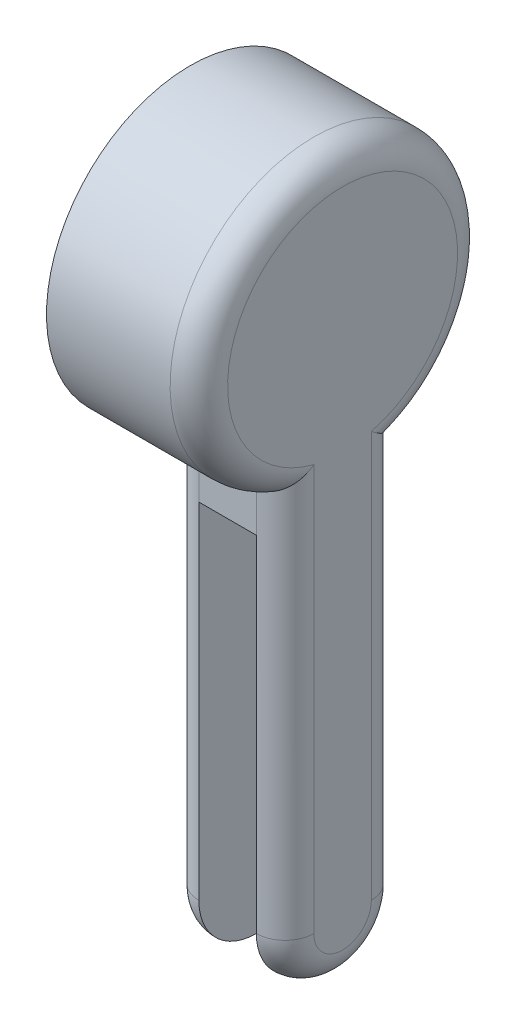
ISO-10303-21;
HEADER;
FILE_DESCRIPTION(('STEP AP214'),'2;1');
FILE_NAME('part.step','',(''),(''),'','','');
FILE_SCHEMA(('AUTOMOTIVE_DESIGN { 1 0 10303 214 1 1 1 1 }'));
ENDSEC;
DATA;
#1=APPLICATION_CONTEXT('core data for automotive mechanical design processes');
#2=APPLICATION_PROTOCOL_DEFINITION('international standard','automotive_design',2000,#1);
#3=PRODUCT_CONTEXT('',#1,'mechanical');
#4=PRODUCT('Part','Part','',(#3));
#5=PRODUCT_RELATED_PRODUCT_CATEGORY('part','',(#4));
#6=PRODUCT_DEFINITION_FORMATION('','',#4);
#7=PRODUCT_DEFINITION_CONTEXT('part definition',#1,'design');
#8=PRODUCT_DEFINITION('design','',#6,#7);
#9=PRODUCT_DEFINITION_SHAPE('','',#8);
#10=(LENGTH_UNIT() NAMED_UNIT(*) SI_UNIT(.MILLI.,.METRE.));
#11=(NAMED_UNIT(*) PLANE_ANGLE_UNIT() SI_UNIT($,.RADIAN.));
#12=(NAMED_UNIT(*) SI_UNIT($,.STERADIAN.) SOLID_ANGLE_UNIT());
#13=UNCERTAINTY_MEASURE_WITH_UNIT(LENGTH_MEASURE(1.E-05),#10,'distance_accuracy_value','');
#14=(GEOMETRIC_REPRESENTATION_CONTEXT(3) GLOBAL_UNCERTAINTY_ASSIGNED_CONTEXT((#13)) GLOBAL_UNIT_ASSIGNED_CONTEXT((#10,
#11,#12)) REPRESENTATION_CONTEXT('',''));
#15=CARTESIAN_POINT('',(0.,0.,0.));
#16=DIRECTION('',(0.,0.,1.));
#17=DIRECTION('',(1.,0.,0.));
#18=AXIS2_PLACEMENT_3D('',#15,#16,#17);
#19=CARTESIAN_POINT('',(53.,-180.,-20.));
#20=DIRECTION('',(0.,0.,1.));
#21=DIRECTION('',(1.,0.,0.));
#22=AXIS2_PLACEMENT_3D('',#19,#20,#21);
#23=PLANE('',#22);
#24=DIRECTION('',(-1.,0.,0.));
#25=VECTOR('',#24,1.);
#26=CARTESIAN_POINT('',(43.,-60.,-20.));
#27=LINE('',#26,#25);
#28=CARTESIAN_POINT('',(43.,-60.,-20.));
#29=VERTEX_POINT('',#28);
#30=CARTESIAN_POINT('',(23.,-60.,-20.));
#31=VERTEX_POINT('',#30);
#32=EDGE_CURVE('E337',#29,#31,#27,.T.);
#33=ORIENTED_EDGE('',*,*,#32,.T.);
#34=DIRECTION('',(0.,1.,0.));
#35=VECTOR('',#34,1.);
#36=CARTESIAN_POINT('',(23.,-180.,-20.));
#37=LINE('',#36,#35);
#38=CARTESIAN_POINT('',(23.,-45.8257569495584,-20.));
#39=VERTEX_POINT('',#38);
#40=EDGE_CURVE('E181',#31,#39,#37,.T.);
#41=ORIENTED_EDGE('',*,*,#40,.T.);
#42=DIRECTION('',(-1.,0.,0.));
#43=VECTOR('',#42,1.);
#44=CARTESIAN_POINT('',(53.,-45.8257569495584,-20.));
#45=LINE('',#44,#43);
#46=CARTESIAN_POINT('',(43.,-45.8257569495584,-20.));
#47=VERTEX_POINT('',#46);
#48=EDGE_CURVE('E344',#47,#39,#45,.T.);
#49=ORIENTED_EDGE('',*,*,#48,.F.);
#50=DIRECTION('',(0.,1.,0.));
#51=VECTOR('',#50,1.);
#52=CARTESIAN_POINT('',(43.,-180.,-20.));
#53=LINE('',#52,#51);
#54=EDGE_CURVE('E359',#47,#29,#53,.F.);
#55=ORIENTED_EDGE('',*,*,#54,.T.);
#56=EDGE_LOOP('',(#33,#41,#49,#55));
#57=FACE_BOUND('',#56,.T.);
#58=ADVANCED_FACE('F38',(#57),#23,.F.);
#59=CARTESIAN_POINT('',(53.,-180.,20.));
#60=DIRECTION('',(0.,0.,-1.));
#61=DIRECTION('',(-1.,0.,0.));
#62=AXIS2_PLACEMENT_3D('',#59,#60,#61);
#63=PLANE('',#62);
#64=DIRECTION('',(-1.,0.,0.));
#65=VECTOR('',#64,1.);
#66=CARTESIAN_POINT('',(53.,-45.8257569495584,20.));
#67=LINE('',#66,#65);
#68=CARTESIAN_POINT('',(43.,-45.8257569495584,20.));
#69=VERTEX_POINT('',#68);
#70=CARTESIAN_POINT('',(23.,-45.8257569495584,20.));
#71=VERTEX_POINT('',#70);
#72=EDGE_CURVE('E329',#69,#71,#67,.T.);
#73=ORIENTED_EDGE('',*,*,#72,.T.);
#74=DIRECTION('',(0.,-1.,0.));
#75=VECTOR('',#74,1.);
#76=CARTESIAN_POINT('',(23.,-180.,20.));
#77=LINE('',#76,#75);
#78=CARTESIAN_POINT('',(23.,-60.,20.));
#79=VERTEX_POINT('',#78);
#80=EDGE_CURVE('E199',#71,#79,#77,.T.);
#81=ORIENTED_EDGE('',*,*,#80,.T.);
#82=DIRECTION('',(-1.,0.,0.));
#83=VECTOR('',#82,1.);
#84=CARTESIAN_POINT('',(43.,-60.,20.));
#85=LINE('',#84,#83);
#86=CARTESIAN_POINT('',(43.,-60.,20.));
#87=VERTEX_POINT('',#86);
#88=EDGE_CURVE('E328',#87,#79,#85,.T.);
#89=ORIENTED_EDGE('',*,*,#88,.F.);
#90=DIRECTION('',(0.,-1.,0.));
#91=VECTOR('',#90,1.);
#92=CARTESIAN_POINT('',(43.,-45.8257569495584,20.));
#93=LINE('',#92,#91);
#94=EDGE_CURVE('E139',#87,#69,#93,.F.);
#95=ORIENTED_EDGE('',*,*,#94,.T.);
#96=EDGE_LOOP('',(#73,#81,#89,#95));
#97=FACE_BOUND('',#96,.T.);
#98=ADVANCED_FACE('F210',(#97),#63,.F.);
#99=CARTESIAN_POINT('',(13.,0.,0.));
#100=DIRECTION('',(-1.,0.,0.));
#101=DIRECTION('',(0.,0.,1.));
#102=AXIS2_PLACEMENT_3D('',#99,#100,#101);
#103=CYLINDRICAL_SURFACE('',#102,50.);
#104=ORIENTED_EDGE('',*,*,#72,.F.);
#105=CARTESIAN_POINT('',(43.,0.,0.));
#106=DIRECTION('',(1.,0.,0.));
#107=DIRECTION('',(0.,0.,-1.));
#108=AXIS2_PLACEMENT_3D('',#105,#106,#107);
#109=CIRCLE('',#108,50.);
#110=EDGE_CURVE('E153',#69,#47,#109,.F.);
#111=ORIENTED_EDGE('',*,*,#110,.T.);
#112=ORIENTED_EDGE('',*,*,#48,.T.);
#113=CARTESIAN_POINT('',(23.,-45.8257569495584,-20.));
#114=CARTESIAN_POINT('',(22.733172411891,-45.8257201786076,-20.0000417969106));
#115=CARTESIAN_POINT('',(22.4663627564171,-45.8304165320172,-19.9893223832669));
#116=CARTESIAN_POINT('',(21.9348447530826,-45.8490052105227,-19.9466717658857));
#117=CARTESIAN_POINT('',(21.6701357968663,-45.8628947670382,-19.9147469482544));
#118=CARTESIAN_POINT('',(21.1456552930297,-45.8995346485155,-19.8301464181386));
#119=CARTESIAN_POINT('',(20.8858695410568,-45.9222533059332,-19.7775448597637));
#120=CARTESIAN_POINT('',(20.372099606805,-45.9760543948196,-19.6521526004835));
#121=CARTESIAN_POINT('',(20.1181156607144,-46.0071371661308,-19.5793610792356));
#122=CARTESIAN_POINT('',(19.6179028616329,-46.0769953816135,-19.414388842686));
#123=CARTESIAN_POINT('',(19.3716667131745,-46.1157633218345,-19.3222270356669));
#124=CARTESIAN_POINT('',(18.888131762124,-46.2002717492914,-19.1192826739256));
#125=CARTESIAN_POINT('',(18.6508363430202,-46.2460148437686,-19.0084931547591));
#126=CARTESIAN_POINT('',(18.1865843622794,-46.3436404666926,-18.769221565506));
#127=CARTESIAN_POINT('',(17.9596306389994,-46.395524666723,-18.6407346767031));
#128=CARTESIAN_POINT('',(17.5172609662806,-46.5045564410429,-18.3670338344055));
#129=CARTESIAN_POINT('',(17.3018495469936,-46.5617060583289,-18.2218133827172));
#130=CARTESIAN_POINT('',(16.8745442337801,-46.6829500212233,-17.9089790772322));
#131=CARTESIAN_POINT('',(16.6632206133814,-46.747239162107,-17.7406617179133));
#132=CARTESIAN_POINT('',(16.2554312383863,-46.8795340144477,-17.3880636297082));
#133=CARTESIAN_POINT('',(16.0589720914856,-46.9475413558828,-17.203775878701));
#134=CARTESIAN_POINT('',(15.6819753077391,-47.0862335458558,-16.8204680912636));
#135=CARTESIAN_POINT('',(15.5014395774009,-47.156918713565,-16.621446295962));
#136=CARTESIAN_POINT('',(15.1572171513046,-47.2999675814883,-16.2098898243649));
#137=CARTESIAN_POINT('',(14.9935311472187,-47.3723313504588,-15.997354593929));
#138=CARTESIAN_POINT('',(14.6732490677567,-47.5227646527501,-15.5450137513294));
#139=CARTESIAN_POINT('',(14.5179052426721,-47.6008856908527,-15.3043372952467));
#140=CARTESIAN_POINT('',(14.2284379620141,-47.7568220483909,-14.8105688930386));
#141=CARTESIAN_POINT('',(14.0943075320133,-47.8346374600692,-14.5574810634602));
#142=CARTESIAN_POINT('',(13.8481234411305,-47.9889455615224,-14.0404373381537));
#143=CARTESIAN_POINT('',(13.7360672979555,-48.0654383991397,-13.7764826684615));
#144=CARTESIAN_POINT('',(13.5349034988885,-48.2161215661927,-13.2394609702587));
#145=CARTESIAN_POINT('',(13.4457850127287,-48.2903129676698,-12.9663983112364));
#146=CARTESIAN_POINT('',(13.3077590868018,-48.4199990300979,-12.4721410025646));
#147=CARTESIAN_POINT('',(13.254327627832,-48.4760963296847,-12.2523557309361));
#148=CARTESIAN_POINT('',(13.1624076665371,-48.5859685951876,-11.8091394952794));
#149=CARTESIAN_POINT('',(13.1239165514139,-48.6397439657042,-11.5857091758328));
#150=CARTESIAN_POINT('',(13.0621646334489,-48.7446297753596,-11.1361690714212));
#151=CARTESIAN_POINT('',(13.0389015528881,-48.7957406119906,-10.9100596923273));
#152=CARTESIAN_POINT('',(13.007811527566,-48.8950369481206,-10.4560812753516));
#153=CARTESIAN_POINT('',(12.999988752509,-48.9432216540045,-10.2282117788185));
#154=CARTESIAN_POINT('',(13.,-48.9897948556636,-10.));
#155=B_SPLINE_CURVE_WITH_KNOTS('',3,(#113,#114,#115,#116,#117,#118,#119,#120,#121,#122,#123,
#124,#125,#126,#127,#128,#129,#130,#131,#132,#133,#134,#135,#136,#137,#138,#139,#140,#141,#142,
#143,#144,#145,#146,#147,#148,#149,#150,#151,#152,#153,#154),.UNSPECIFIED.,.F.,.F.,(4,2,2,2,2,2,
2,2,2,2,2,2,2,2,2,2,2,2,2,2,4),(0.,0.800198389261815,1.60015590424418,2.39727028671569,
3.19441706164765,3.99078928690009,4.78745992096538,5.58434790635828,6.38154639919073,
7.21376717190406,8.04635574383077,8.87904386649081,9.71176615693086,10.6014885664538,
11.4909178469336,12.3802470523397,13.2691555776405,13.9677836149283,14.666289419598,
15.3646907220201,16.0632806041697),.UNSPECIFIED.);
#156=CARTESIAN_POINT('',(13.,-48.9897948556636,-10.));
#157=VERTEX_POINT('',#156);
#158=EDGE_CURVE('E48',#39,#157,#155,.T.);
#159=ORIENTED_EDGE('',*,*,#158,.T.);
#160=CARTESIAN_POINT('',(13.,0.,0.));
#161=DIRECTION('',(1.,0.,0.));
#162=DIRECTION('',(0.,0.,-1.));
#163=AXIS2_PLACEMENT_3D('',#160,#161,#162);
#164=CIRCLE('',#163,50.);
#165=CARTESIAN_POINT('',(13.,-48.9897948556636,9.99999999999998));
#166=VERTEX_POINT('',#165);
#167=EDGE_CURVE('E348',#166,#157,#164,.T.);
#168=ORIENTED_EDGE('',*,*,#167,.F.);
#169=CARTESIAN_POINT('',(13.,-48.9897948556636,9.99999999999998));
#170=CARTESIAN_POINT('',(12.9999711646464,-48.9306823137974,10.2897218792389));
#171=CARTESIAN_POINT('',(13.0125889412409,-48.8689557468884,10.5788780243558));
#172=CARTESIAN_POINT('',(13.0626184420573,-48.7409047169235,11.1539345090059));
#173=CARTESIAN_POINT('',(13.100023656346,-48.6745814651906,11.439835683345));
#174=CARTESIAN_POINT('',(13.1990425622559,-48.5380550763351,12.005916516337));
#175=CARTESIAN_POINT('',(13.2606137840736,-48.4678589305076,12.2861053102109));
#176=CARTESIAN_POINT('',(13.4073111638424,-48.3242308404643,12.8394067793973));
#177=CARTESIAN_POINT('',(13.492438492249,-48.2507987356127,13.1125191023567));
#178=CARTESIAN_POINT('',(13.6854286134939,-48.1016002570285,13.6496782732875));
#179=CARTESIAN_POINT('',(13.7932743618559,-48.0258356694225,13.913731745913));
#180=CARTESIAN_POINT('',(14.0309580429932,-47.8728226232139,14.4314148877676));
#181=CARTESIAN_POINT('',(14.1608035614203,-47.7955736609633,14.6850409239433));
#182=CARTESIAN_POINT('',(14.441610555564,-47.6406054098175,15.1802520492929));
#183=CARTESIAN_POINT('',(14.592576876446,-47.5628860169294,15.4218343583087));
#184=CARTESIAN_POINT('',(14.9146653219489,-47.408068867688,15.8913853468729));
#185=CARTESIAN_POINT('',(15.0857878494446,-47.330971123793,16.1193537541742));
#186=CARTESIAN_POINT('',(15.4511350542317,-47.1768691492842,16.5650179396242));
#187=CARTESIAN_POINT('',(15.6457824115839,-47.0999036806367,16.7823809467175));
#188=CARTESIAN_POINT('',(16.0538550193943,-46.9491029068784,17.1997372907047));
#189=CARTESIAN_POINT('',(16.2672737550504,-46.8752665288643,17.3997366063374));
#190=CARTESIAN_POINT('',(16.7117503616803,-46.7319827026518,17.7809810003146));
#191=CARTESIAN_POINT('',(16.9428134590642,-46.6625365661018,17.9622204840984));
#192=CARTESIAN_POINT('',(17.4210953654107,-46.5293928929305,18.3043520545763));
#193=CARTESIAN_POINT('',(17.6683132393237,-46.4656950241028,18.4652453173445));
#194=CARTESIAN_POINT('',(18.1709401852927,-46.3468721566981,18.761457314944));
#195=CARTESIAN_POINT('',(18.4259905237507,-46.2915727937897,18.8973143788695));
#196=CARTESIAN_POINT('',(18.9481908554879,-46.1888814647075,19.1469437971775));
#197=CARTESIAN_POINT('',(19.2153396369174,-46.1414887087799,19.2607183574629));
#198=CARTESIAN_POINT('',(19.7594410318066,-46.0557543674818,19.4648335315624));
#199=CARTESIAN_POINT('',(20.0363796693643,-46.0174004343493,19.5552061312249));
#200=CARTESIAN_POINT('',(20.5980732440866,-45.9506142393806,19.7116281822157));
#201=CARTESIAN_POINT('',(20.8828247342069,-45.9221776755634,19.7776881806137));
#202=CARTESIAN_POINT('',(21.4713765193304,-45.8748573444654,19.8872128432905));
#203=CARTESIAN_POINT('',(21.7754451103175,-45.8564821484919,19.9294772022673));
#204=CARTESIAN_POINT('',(22.2336255450516,-45.8380689418226,19.9717709950244));
#205=CARTESIAN_POINT('',(22.3866594958543,-45.8334561483077,19.9823517914708));
#206=CARTESIAN_POINT('',(22.6931198553567,-45.8272991439083,19.9964668411992));
#207=CARTESIAN_POINT('',(22.8465462800484,-45.8257550601245,20.0000008026137));
#208=CARTESIAN_POINT('',(23.,-45.8257569495584,20.));
#209=B_SPLINE_CURVE_WITH_KNOTS('',3,(#169,#170,#171,#172,#173,#174,#175,#176,#177,#178,#179,
#180,#181,#182,#183,#184,#185,#186,#187,#188,#189,#190,#191,#192,#193,#194,#195,#196,#197,#198,
#199,#200,#201,#202,#203,#204,#205,#206,#207,#208),.UNSPECIFIED.,.F.,.F.,(4,2,2,2,2,2,2,2,2,2,2,
2,2,2,2,2,2,2,2,4),(0.,0.886745482094388,1.77325817016698,2.65821981015372,3.54322542999487,
4.42756942485865,5.3122189696797,6.1970717891307,7.08194229770079,7.98612434335413,
8.88999381219723,9.79413206123015,10.6982180243845,11.5797263720483,12.4611466172078,
13.3413556995261,14.2211824862696,15.1421287956645,15.6023682998851,16.0626268660279),.UNSPECIFIED.);
#210=EDGE_CURVE('E11',#166,#71,#209,.T.);
#211=ORIENTED_EDGE('',*,*,#210,.T.);
#212=EDGE_LOOP('',(#104,#111,#112,#159,#168,#211));
#213=FACE_BOUND('',#212,.T.);
#214=CARTESIAN_POINT('',(0.,0.,0.));
#215=DIRECTION('',(1.,0.,0.));
#216=DIRECTION('',(0.,0.,-1.));
#217=AXIS2_PLACEMENT_3D('',#214,#215,#216);
#218=CIRCLE('',#217,50.);
#219=CARTESIAN_POINT('',(0.,0.,-50.));
#220=VERTEX_POINT('',#219);
#221=EDGE_CURVE('E347',#220,#220,#218,.T.);
#222=ORIENTED_EDGE('',*,*,#221,.T.);
#223=EDGE_LOOP('',(#222));
#224=FACE_BOUND('',#223,.T.);
#225=ADVANCED_FACE('F205',(#213,#224),#103,.T.);
#226=CARTESIAN_POINT('',(0.,0.,0.));
#227=DIRECTION('',(1.,0.,0.));
#228=DIRECTION('',(0.,0.,-1.));
#229=AXIS2_PLACEMENT_3D('',#226,#227,#228);
#230=PLANE('',#229);
#231=ORIENTED_EDGE('',*,*,#221,.F.);
#232=EDGE_LOOP('',(#231));
#233=FACE_BOUND('',#232,.T.);
#234=ADVANCED_FACE('F209',(#233),#230,.F.);
#235=CARTESIAN_POINT('',(13.,-180.,0.));
#236=DIRECTION('',(1.,0.,0.));
#237=DIRECTION('',(0.,0.,-1.));
#238=AXIS2_PLACEMENT_3D('',#235,#236,#237);
#239=PLANE('',#238);
#240=ORIENTED_EDGE('',*,*,#167,.T.);
#241=DIRECTION('',(0.,1.,0.));
#242=VECTOR('',#241,1.);
#243=CARTESIAN_POINT('',(13.,-180.,-10.));
#244=LINE('',#243,#242);
#245=CARTESIAN_POINT('',(13.,-180.,-10.));
#246=VERTEX_POINT('',#245);
#247=EDGE_CURVE('E62',#157,#246,#244,.F.);
#248=ORIENTED_EDGE('',*,*,#247,.T.);
#249=CARTESIAN_POINT('',(13.,-180.,0.));
#250=DIRECTION('',(1.,0.,0.));
#251=DIRECTION('',(0.,0.,-1.));
#252=AXIS2_PLACEMENT_3D('',#249,#250,#251);
#253=CIRCLE('',#252,10.);
#254=CARTESIAN_POINT('',(13.,-180.,9.99999999999998));
#255=VERTEX_POINT('',#254);
#256=EDGE_CURVE('E318',#246,#255,#253,.F.);
#257=ORIENTED_EDGE('',*,*,#256,.T.);
#258=DIRECTION('',(0.,-1.,0.));
#259=VECTOR('',#258,1.);
#260=CARTESIAN_POINT('',(13.,-180.,9.99999999999998));
#261=LINE('',#260,#259);
#262=EDGE_CURVE('E324',#255,#166,#261,.F.);
#263=ORIENTED_EDGE('',*,*,#262,.T.);
#264=EDGE_LOOP('',(#240,#248,#257,#263));
#265=FACE_BOUND('',#264,.T.);
#266=ADVANCED_FACE('F214',(#265),#239,.F.);
#267=CARTESIAN_POINT('',(53.,-180.,0.));
#268=DIRECTION('',(1.,0.,0.));
#269=DIRECTION('',(0.,0.,-1.));
#270=AXIS2_PLACEMENT_3D('',#267,#268,#269);
#271=PLANE('',#270);
#272=CARTESIAN_POINT('',(53.,0.,0.));
#273=DIRECTION('',(1.,0.,0.));
#274=DIRECTION('',(0.,0.,-1.));
#275=AXIS2_PLACEMENT_3D('',#272,#273,#274);
#276=CIRCLE('',#275,40.);
#277=CARTESIAN_POINT('',(53.,-38.7298334620742,-10.));
#278=VERTEX_POINT('',#277);
#279=CARTESIAN_POINT('',(53.,-38.7298334620742,9.99999999999998));
#280=VERTEX_POINT('',#279);
#281=EDGE_CURVE('E350',#278,#280,#276,.T.);
#282=ORIENTED_EDGE('',*,*,#281,.T.);
#283=DIRECTION('',(0.,-1.,0.));
#284=VECTOR('',#283,1.);
#285=CARTESIAN_POINT('',(53.,-180.,9.99999999999998));
#286=LINE('',#285,#284);
#287=CARTESIAN_POINT('',(53.,-180.,9.99999999999998));
#288=VERTEX_POINT('',#287);
#289=EDGE_CURVE('E357',#280,#288,#286,.T.);
#290=ORIENTED_EDGE('',*,*,#289,.T.);
#291=CARTESIAN_POINT('',(53.,-180.,0.));
#292=DIRECTION('',(1.,0.,0.));
#293=DIRECTION('',(0.,0.,-1.));
#294=AXIS2_PLACEMENT_3D('',#291,#292,#293);
#295=CIRCLE('',#294,10.);
#296=CARTESIAN_POINT('',(53.,-180.,-10.));
#297=VERTEX_POINT('',#296);
#298=EDGE_CURVE('E144',#288,#297,#295,.T.);
#299=ORIENTED_EDGE('',*,*,#298,.T.);
#300=DIRECTION('',(0.,1.,0.));
#301=VECTOR('',#300,1.);
#302=CARTESIAN_POINT('',(53.,-45.8257569495584,-10.));
#303=LINE('',#302,#301);
#304=EDGE_CURVE('E354',#297,#278,#303,.T.);
#305=ORIENTED_EDGE('',*,*,#304,.T.);
#306=EDGE_LOOP('',(#282,#290,#299,#305));
#307=FACE_BOUND('',#306,.T.);
#308=ADVANCED_FACE('F224',(#307),#271,.T.);
#309=CARTESIAN_POINT('',(43.,-60.,20.));
#310=DIRECTION('',(0.,1.,0.));
#311=DIRECTION('',(0.,0.,1.));
#312=AXIS2_PLACEMENT_3D('',#309,#310,#311);
#313=PLANE('',#312);
#314=DIRECTION('',(0.,0.,-1.));
#315=VECTOR('',#314,1.);
#316=CARTESIAN_POINT('',(23.,-60.,20.));
#317=LINE('',#316,#315);
#318=EDGE_CURVE('E332',#79,#31,#317,.T.);
#319=ORIENTED_EDGE('',*,*,#318,.T.);
#320=ORIENTED_EDGE('',*,*,#32,.F.);
#321=DIRECTION('',(0.,0.,-1.));
#322=VECTOR('',#321,1.);
#323=CARTESIAN_POINT('',(43.,-60.,20.));
#324=LINE('',#323,#322);
#325=EDGE_CURVE('E141',#87,#29,#324,.T.);
#326=ORIENTED_EDGE('',*,*,#325,.F.);
#327=ORIENTED_EDGE('',*,*,#88,.T.);
#328=EDGE_LOOP('',(#319,#320,#326,#327));
#329=FACE_BOUND('',#328,.T.);
#330=ADVANCED_FACE('F227',(#329),#313,.F.);
#331=CARTESIAN_POINT('',(43.,-180.,0.));
#332=DIRECTION('',(-1.,0.,0.));
#333=DIRECTION('',(0.,0.,1.));
#334=AXIS2_PLACEMENT_3D('',#331,#332,#333);
#335=PLANE('',#334);
#336=CARTESIAN_POINT('',(43.,-180.,0.));
#337=DIRECTION('',(-1.,0.,0.));
#338=DIRECTION('',(0.,0.,1.));
#339=AXIS2_PLACEMENT_3D('',#336,#337,#338);
#340=CIRCLE('',#339,20.);
#341=CARTESIAN_POINT('',(43.,-180.,-20.));
#342=VERTEX_POINT('',#341);
#343=CARTESIAN_POINT('',(43.,-180.,20.));
#344=VERTEX_POINT('',#343);
#345=EDGE_CURVE('E119',#342,#344,#340,.T.);
#346=ORIENTED_EDGE('',*,*,#345,.T.);
#347=DIRECTION('',(0.,1.,0.));
#348=VECTOR('',#347,1.);
#349=CARTESIAN_POINT('',(43.,-180.,20.));
#350=LINE('',#349,#348);
#351=EDGE_CURVE('E123',#344,#87,#350,.T.);
#352=ORIENTED_EDGE('',*,*,#351,.T.);
#353=ORIENTED_EDGE('',*,*,#325,.T.);
#354=DIRECTION('',(0.,-1.,0.));
#355=VECTOR('',#354,1.);
#356=CARTESIAN_POINT('',(43.,-60.,-20.));
#357=LINE('',#356,#355);
#358=EDGE_CURVE('E126',#29,#342,#357,.T.);
#359=ORIENTED_EDGE('',*,*,#358,.T.);
#360=EDGE_LOOP('',(#346,#352,#353,#359));
#361=FACE_BOUND('',#360,.T.);
#362=ADVANCED_FACE('F121',(#361),#335,.T.);
#363=CARTESIAN_POINT('',(23.,-180.,0.));
#364=DIRECTION('',(-1.,0.,0.));
#365=DIRECTION('',(0.,0.,1.));
#366=AXIS2_PLACEMENT_3D('',#363,#364,#365);
#367=PLANE('',#366);
#368=CARTESIAN_POINT('',(23.,-180.,0.));
#369=DIRECTION('',(-1.,0.,0.));
#370=DIRECTION('',(0.,0.,1.));
#371=AXIS2_PLACEMENT_3D('',#368,#369,#370);
#372=CIRCLE('',#371,20.);
#373=CARTESIAN_POINT('',(23.,-180.,-20.));
#374=VERTEX_POINT('',#373);
#375=CARTESIAN_POINT('',(23.,-180.,20.));
#376=VERTEX_POINT('',#375);
#377=EDGE_CURVE('E180',#374,#376,#372,.T.);
#378=ORIENTED_EDGE('',*,*,#377,.F.);
#379=DIRECTION('',(0.,-1.,0.));
#380=VECTOR('',#379,1.);
#381=CARTESIAN_POINT('',(23.,-60.,-20.));
#382=LINE('',#381,#380);
#383=EDGE_CURVE('E131',#31,#374,#382,.T.);
#384=ORIENTED_EDGE('',*,*,#383,.F.);
#385=ORIENTED_EDGE('',*,*,#318,.F.);
#386=DIRECTION('',(0.,1.,0.));
#387=VECTOR('',#386,1.);
#388=CARTESIAN_POINT('',(23.,-180.,20.));
#389=LINE('',#388,#387);
#390=EDGE_CURVE('E323',#376,#79,#389,.T.);
#391=ORIENTED_EDGE('',*,*,#390,.F.);
#392=EDGE_LOOP('',(#378,#384,#385,#391));
#393=FACE_BOUND('',#392,.T.);
#394=ADVANCED_FACE('F186',(#393),#367,.F.);
#395=CARTESIAN_POINT('',(43.,-180.,-10.));
#396=DIRECTION('',(0.,-1.,0.));
#397=DIRECTION('',(0.,0.,-1.));
#398=AXIS2_PLACEMENT_3D('',#395,#396,#397);
#399=CYLINDRICAL_SURFACE('',#398,10.);
#400=ORIENTED_EDGE('',*,*,#358,.F.);
#401=ORIENTED_EDGE('',*,*,#54,.F.);
#402=CARTESIAN_POINT('',(43.,-45.8257569495584,-20.));
#403=CARTESIAN_POINT('',(43.1237761906737,-45.8257573549389,-20.0000009798277));
#404=CARTESIAN_POINT('',(43.2475356709395,-45.8242521864083,-19.997701391254));
#405=CARTESIAN_POINT('',(43.4948084849058,-45.8182390808218,-19.988516989277));
#406=CARTESIAN_POINT('',(43.6183218242628,-45.8137312135848,-19.9816322824872));
#407=CARTESIAN_POINT('',(43.9880346760222,-45.7957232123601,-19.9541351624558));
#408=CARTESIAN_POINT('',(44.2335556270845,-45.777738657232,-19.9266797095041));
#409=CARTESIAN_POINT('',(44.7196039938604,-45.7301427635176,-19.8540899742878));
#410=CARTESIAN_POINT('',(44.9601493251192,-45.7005858974201,-19.8090385212401));
#411=CARTESIAN_POINT('',(45.435739974872,-45.6301914230334,-19.7018855281728));
#412=CARTESIAN_POINT('',(45.6707850234649,-45.5893532624203,-19.6397831533533));
#413=CARTESIAN_POINT('',(46.1334801862071,-45.4969178914732,-19.499456785894));
#414=CARTESIAN_POINT('',(46.3611394708155,-45.4453346636971,-19.4212537465751));
#415=CARTESIAN_POINT('',(46.8080974860876,-45.3319009441147,-19.2496337917041));
#416=CARTESIAN_POINT('',(47.0273930012703,-45.2700465514892,-19.1562110962334));
#417=CARTESIAN_POINT('',(47.4564905693584,-45.136651283456,-18.9552140156089));
#418=CARTESIAN_POINT('',(47.6662870380165,-45.0651048064863,-18.8476314477535));
#419=CARTESIAN_POINT('',(48.0753102253933,-44.9129916434237,-18.6195172251371));
#420=CARTESIAN_POINT('',(48.2745357806984,-44.8324239674981,-18.4989841494667));
#421=CARTESIAN_POINT('',(48.6723412925707,-44.6582424581677,-18.2391771521714));
#422=CARTESIAN_POINT('',(48.8702776504168,-44.5641538024964,-18.0992357859871));
#423=CARTESIAN_POINT('',(49.252821427956,-44.3674591155988,-17.8076956824475));
#424=CARTESIAN_POINT('',(49.4374281538179,-44.2648526416017,-17.6560963391204));
#425=CARTESIAN_POINT('',(49.9705280436353,-43.945359789664,-17.1858232411068));
#426=CARTESIAN_POINT('',(50.2984923717943,-43.7167152117221,-16.8515475181961));
#427=CARTESIAN_POINT('',(50.9427365755085,-43.1972407919294,-16.098739337094));
#428=CARTESIAN_POINT('',(51.2496388511132,-42.9022430000191,-15.6751267589746));
#429=CARTESIAN_POINT('',(51.7878413057122,-42.2857387867787,-14.7998085799085));
#430=CARTESIAN_POINT('',(52.0190658693227,-41.9642062516722,-14.3480754145215));
#431=CARTESIAN_POINT('',(52.4424084806215,-41.2413367013629,-13.3449151020652));
#432=CARTESIAN_POINT('',(52.6199569636576,-40.8360639344824,-12.7901991398613));
#433=CARTESIAN_POINT('',(52.8756601401657,-40.0069581468251,-11.6730860176179));
#434=CARTESIAN_POINT('',(52.9539406158997,-39.5831493192645,-11.1106994925666));
#435=CARTESIAN_POINT('',(52.994670909981,-39.0172927585095,-10.3721718124532));
#436=CARTESIAN_POINT('',(52.9997013110605,-38.8800191290259,-10.1939485316357));
#437=CARTESIAN_POINT('',(52.999995694678,-38.7381308244658,-10.0107127110577));
#438=CARTESIAN_POINT('',(52.9999999979034,-38.7339823538704,-10.0053561979218));
#439=CARTESIAN_POINT('',(53.,-38.7298334620742,-10.));
#440=B_SPLINE_CURVE_WITH_KNOTS('',3,(#402,#403,#404,#405,#406,#407,#408,#409,#410,#411,#412,
#413,#414,#415,#416,#417,#418,#419,#420,#421,#422,#423,#424,#425,#426,#427,#428,#429,#430,#431,
#432,#433,#434,#435,#436,#437,#438,#439),.UNSPECIFIED.,.F.,.F.,(4,2,2,2,2,2,2,2,2,2,2,2,2,2,2,2,
2,2,4),(0.,0.371264884866302,0.742521137354679,1.48458940914703,2.22320586331833,
2.96185848601962,3.69955583837828,4.43753399951237,5.17594051111011,5.91442812240139,
6.69371003419391,7.47303247981004,9.03095010136926,10.8260105154985,12.6228590746228,
14.7437086343091,16.8618681764454,17.536791511739,17.5571168258276),.UNSPECIFIED.);
#441=EDGE_CURVE('E173',#278,#47,#440,.F.);
#442=ORIENTED_EDGE('',*,*,#441,.F.);
#443=ORIENTED_EDGE('',*,*,#304,.F.);
#444=CARTESIAN_POINT('',(43.,-180.,-10.));
#445=DIRECTION('',(0.,-1.,0.));
#446=DIRECTION('',(0.,0.,-1.));
#447=AXIS2_PLACEMENT_3D('',#444,#445,#446);
#448=CIRCLE('',#447,10.);
#449=EDGE_CURVE('E148',#342,#297,#448,.T.);
#450=ORIENTED_EDGE('',*,*,#449,.F.);
#451=EDGE_LOOP('',(#400,#401,#442,#443,#450));
#452=FACE_BOUND('',#451,.T.);
#453=ADVANCED_FACE('F169',(#452),#399,.T.);
#454=CARTESIAN_POINT('',(43.,0.,0.));
#455=DIRECTION('',(1.,0.,0.));
#456=DIRECTION('',(0.,0.,-1.));
#457=AXIS2_PLACEMENT_3D('',#454,#455,#456);
#458=TOROIDAL_SURFACE('',#457,40.,10.);
#459=ORIENTED_EDGE('',*,*,#441,.T.);
#460=ORIENTED_EDGE('',*,*,#110,.F.);
#461=CARTESIAN_POINT('',(43.,-45.8257569495584,20.));
#462=CARTESIAN_POINT('',(43.1237761906737,-45.8257573549389,20.0000009798276));
#463=CARTESIAN_POINT('',(43.2475356709395,-45.8242521864083,19.9977013912539));
#464=CARTESIAN_POINT('',(43.4948084849058,-45.8182390808218,19.988516989277));
#465=CARTESIAN_POINT('',(43.6183218242628,-45.8137312135848,19.9816322824872));
#466=CARTESIAN_POINT('',(43.9880346760222,-45.7957232123601,19.9541351624557));
#467=CARTESIAN_POINT('',(44.2335556270845,-45.777738657232,19.9266797095041));
#468=CARTESIAN_POINT('',(44.7196039938604,-45.7301427635176,19.8540899742877));
#469=CARTESIAN_POINT('',(44.9601493251192,-45.7005858974201,19.8090385212401));
#470=CARTESIAN_POINT('',(45.435739974872,-45.6301914230334,19.7018855281727));
#471=CARTESIAN_POINT('',(45.6707850234649,-45.5893532624203,19.6397831533533));
#472=CARTESIAN_POINT('',(46.1334801862071,-45.4969178914732,19.4994567858939));
#473=CARTESIAN_POINT('',(46.3611394708155,-45.4453346636971,19.421253746575));
#474=CARTESIAN_POINT('',(46.8080974860876,-45.3319009441147,19.2496337917041));
#475=CARTESIAN_POINT('',(47.0273930012703,-45.2700465514892,19.1562110962334));
#476=CARTESIAN_POINT('',(47.4564905693584,-45.136651283456,18.9552140156088));
#477=CARTESIAN_POINT('',(47.6662870380165,-45.0651048064863,18.8476314477535));
#478=CARTESIAN_POINT('',(48.0753102253933,-44.9129916434237,18.6195172251371));
#479=CARTESIAN_POINT('',(48.2745357806984,-44.8324239674981,18.4989841494667));
#480=CARTESIAN_POINT('',(48.6723412925707,-44.6582424581677,18.2391771521713));
#481=CARTESIAN_POINT('',(48.8702776504168,-44.5641538024964,18.0992357859871));
#482=CARTESIAN_POINT('',(49.252821427956,-44.3674591155989,17.8076956824475));
#483=CARTESIAN_POINT('',(49.4374281538179,-44.2648526416017,17.6560963391204));
#484=CARTESIAN_POINT('',(49.9705280436353,-43.945359789664,17.1858232411067));
#485=CARTESIAN_POINT('',(50.2984923717943,-43.7167152117221,16.8515475181961));
#486=CARTESIAN_POINT('',(50.9427365755085,-43.1972407919294,16.098739337094));
#487=CARTESIAN_POINT('',(51.2496388511132,-42.9022430000191,15.6751267589746));
#488=CARTESIAN_POINT('',(51.7878413057122,-42.2857387867787,14.7998085799085));
#489=CARTESIAN_POINT('',(52.0190658693227,-41.9642062516722,14.3480754145215));
#490=CARTESIAN_POINT('',(52.4424084806215,-41.2413367013629,13.3449151020651));
#491=CARTESIAN_POINT('',(52.6199569636576,-40.8360639344825,12.7901991398612));
#492=CARTESIAN_POINT('',(52.8756601401657,-40.0069581468251,11.6730860176179));
#493=CARTESIAN_POINT('',(52.9539406158997,-39.5831493192644,11.1106994925667));
#494=CARTESIAN_POINT('',(52.994670909981,-39.0172927585096,10.3721718124531));
#495=CARTESIAN_POINT('',(52.9997013110605,-38.8800191290261,10.1939485316356));
#496=CARTESIAN_POINT('',(52.999995694678,-38.7381308244659,10.0107127110576));
#497=CARTESIAN_POINT('',(52.9999999979034,-38.7339823538704,10.0053561979217));
#498=CARTESIAN_POINT('',(53.,-38.7298334620742,9.99999999999998));
#499=B_SPLINE_CURVE_WITH_KNOTS('',3,(#461,#462,#463,#464,#465,#466,#467,#468,#469,#470,#471,
#472,#473,#474,#475,#476,#477,#478,#479,#480,#481,#482,#483,#484,#485,#486,#487,#488,#489,#490,
#491,#492,#493,#494,#495,#496,#497,#498),.UNSPECIFIED.,.F.,.F.,(4,2,2,2,2,2,2,2,2,2,2,2,2,2,2,2,
2,2,4),(0.,0.371264884866302,0.742521137354678,1.48458940914703,2.22320586331833,
2.96185848601962,3.69955583837828,4.43753399951237,5.17594051111011,5.91442812240138,
6.6937100341939,7.47303247981004,9.03095010136926,10.8260105154985,12.6228590746228,
14.7437086343091,16.8618681764454,17.536791511739,17.5571168258276),.UNSPECIFIED.);
#500=EDGE_CURVE('E146',#280,#69,#499,.F.);
#501=ORIENTED_EDGE('',*,*,#500,.F.);
#502=ORIENTED_EDGE('',*,*,#281,.F.);
#503=EDGE_LOOP('',(#459,#460,#501,#502));
#504=FACE_BOUND('',#503,.T.);
#505=ADVANCED_FACE('F165',(#504),#458,.T.);
#506=CARTESIAN_POINT('',(43.,-180.,0.));
#507=DIRECTION('',(1.,0.,0.));
#508=DIRECTION('',(0.,0.,-1.));
#509=AXIS2_PLACEMENT_3D('',#506,#507,#508);
#510=DEGENERATE_TOROIDAL_SURFACE('',#509,10.,10.,.T.);
#511=ORIENTED_EDGE('',*,*,#449,.T.);
#512=ORIENTED_EDGE('',*,*,#298,.F.);
#513=CARTESIAN_POINT('',(43.,-180.,9.99999999999998));
#514=DIRECTION('',(0.,1.,0.));
#515=DIRECTION('',(0.,0.,1.));
#516=AXIS2_PLACEMENT_3D('',#513,#514,#515);
#517=CIRCLE('',#516,10.);
#518=EDGE_CURVE('E136',#344,#288,#517,.T.);
#519=ORIENTED_EDGE('',*,*,#518,.F.);
#520=ORIENTED_EDGE('',*,*,#345,.F.);
#521=EDGE_LOOP('',(#511,#512,#519,#520));
#522=FACE_BOUND('',#521,.T.);
#523=ADVANCED_FACE('F143',(#522),#510,.T.);
#524=CARTESIAN_POINT('',(43.,-180.,9.99999999999998));
#525=DIRECTION('',(0.,1.,0.));
#526=DIRECTION('',(0.,0.,1.));
#527=AXIS2_PLACEMENT_3D('',#524,#525,#526);
#528=CYLINDRICAL_SURFACE('',#527,10.);
#529=ORIENTED_EDGE('',*,*,#94,.F.);
#530=ORIENTED_EDGE('',*,*,#351,.F.);
#531=ORIENTED_EDGE('',*,*,#518,.T.);
#532=ORIENTED_EDGE('',*,*,#289,.F.);
#533=ORIENTED_EDGE('',*,*,#500,.T.);
#534=EDGE_LOOP('',(#529,#530,#531,#532,#533));
#535=FACE_BOUND('',#534,.T.);
#536=ADVANCED_FACE('F134',(#535),#528,.T.);
#537=CARTESIAN_POINT('',(23.,-180.,9.99999999999998));
#538=DIRECTION('',(0.,-1.,0.));
#539=DIRECTION('',(0.,0.,-1.));
#540=AXIS2_PLACEMENT_3D('',#537,#538,#539);
#541=CYLINDRICAL_SURFACE('',#540,10.);
#542=ORIENTED_EDGE('',*,*,#210,.F.);
#543=ORIENTED_EDGE('',*,*,#262,.F.);
#544=CARTESIAN_POINT('',(23.,-180.,9.99999999999998));
#545=DIRECTION('',(0.,-1.,0.));
#546=DIRECTION('',(0.,0.,-1.));
#547=AXIS2_PLACEMENT_3D('',#544,#545,#546);
#548=CIRCLE('',#547,10.);
#549=EDGE_CURVE('E43',#376,#255,#548,.T.);
#550=ORIENTED_EDGE('',*,*,#549,.F.);
#551=ORIENTED_EDGE('',*,*,#390,.T.);
#552=ORIENTED_EDGE('',*,*,#80,.F.);
#553=EDGE_LOOP('',(#542,#543,#550,#551,#552));
#554=FACE_BOUND('',#553,.T.);
#555=ADVANCED_FACE('F40',(#554),#541,.T.);
#556=CARTESIAN_POINT('',(23.,-180.,0.));
#557=DIRECTION('',(1.,0.,0.));
#558=DIRECTION('',(0.,0.,-1.));
#559=AXIS2_PLACEMENT_3D('',#556,#557,#558);
#560=DEGENERATE_TOROIDAL_SURFACE('',#559,10.,10.,.T.);
#561=ORIENTED_EDGE('',*,*,#549,.T.);
#562=ORIENTED_EDGE('',*,*,#256,.F.);
#563=CARTESIAN_POINT('',(23.,-180.,-10.));
#564=DIRECTION('',(0.,1.,0.));
#565=DIRECTION('',(0.,0.,1.));
#566=AXIS2_PLACEMENT_3D('',#563,#564,#565);
#567=CIRCLE('',#566,10.);
#568=EDGE_CURVE('E151',#374,#246,#567,.T.);
#569=ORIENTED_EDGE('',*,*,#568,.F.);
#570=ORIENTED_EDGE('',*,*,#377,.T.);
#571=EDGE_LOOP('',(#561,#562,#569,#570));
#572=FACE_BOUND('',#571,.T.);
#573=ADVANCED_FACE('F191',(#572),#560,.T.);
#574=CARTESIAN_POINT('',(23.,-180.,-10.));
#575=DIRECTION('',(0.,1.,0.));
#576=DIRECTION('',(0.,0.,1.));
#577=AXIS2_PLACEMENT_3D('',#574,#575,#576);
#578=CYLINDRICAL_SURFACE('',#577,10.);
#579=ORIENTED_EDGE('',*,*,#568,.T.);
#580=ORIENTED_EDGE('',*,*,#247,.F.);
#581=ORIENTED_EDGE('',*,*,#158,.F.);
#582=ORIENTED_EDGE('',*,*,#40,.F.);
#583=ORIENTED_EDGE('',*,*,#383,.T.);
#584=EDGE_LOOP('',(#579,#580,#581,#582,#583));
#585=FACE_BOUND('',#584,.T.);
#586=ADVANCED_FACE('F188',(#585),#578,.T.);
#587=CLOSED_SHELL('',(#58,#98,#225,#234,#266,#308,#330,#362,#394,#453,#505,#523,#536,#555,#573,#586));
#588=MANIFOLD_SOLID_BREP('B2',#587);
#589=ADVANCED_BREP_SHAPE_REPRESENTATION('',(#18,#588),#14);
#590=SHAPE_DEFINITION_REPRESENTATION(#9,#589);
ENDSEC;
END-ISO-10303-21;
